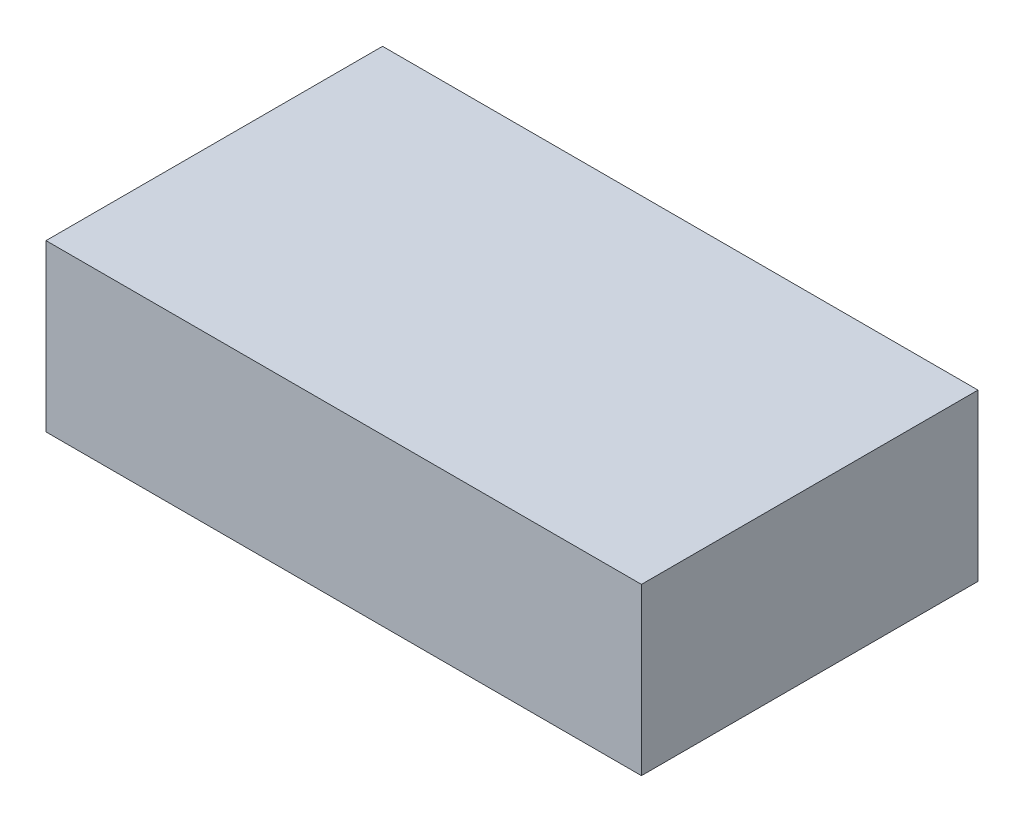
ISO-10303-21;
HEADER;
FILE_DESCRIPTION(('STEP AP214'),'2;1');
FILE_NAME('part.step','',(''),(''),'','','');
FILE_SCHEMA(('AUTOMOTIVE_DESIGN { 1 0 10303 214 1 1 1 1 }'));
ENDSEC;
DATA;
#1=APPLICATION_CONTEXT('core data for automotive mechanical design processes');
#2=APPLICATION_PROTOCOL_DEFINITION('international standard','automotive_design',2000,#1);
#3=PRODUCT_CONTEXT('',#1,'mechanical');
#4=PRODUCT('Part','Part','',(#3));
#5=PRODUCT_RELATED_PRODUCT_CATEGORY('part','',(#4));
#6=PRODUCT_DEFINITION_FORMATION('','',#4);
#7=PRODUCT_DEFINITION_CONTEXT('part definition',#1,'design');
#8=PRODUCT_DEFINITION('design','',#6,#7);
#9=PRODUCT_DEFINITION_SHAPE('','',#8);
#10=(LENGTH_UNIT() NAMED_UNIT(*) SI_UNIT(.MILLI.,.METRE.));
#11=(NAMED_UNIT(*) PLANE_ANGLE_UNIT() SI_UNIT($,.RADIAN.));
#12=(NAMED_UNIT(*) SI_UNIT($,.STERADIAN.) SOLID_ANGLE_UNIT());
#13=UNCERTAINTY_MEASURE_WITH_UNIT(LENGTH_MEASURE(1.E-05),#10,'distance_accuracy_value','');
#14=(GEOMETRIC_REPRESENTATION_CONTEXT(3) GLOBAL_UNCERTAINTY_ASSIGNED_CONTEXT((#13)) GLOBAL_UNIT_ASSIGNED_CONTEXT((#10,
#11,#12)) REPRESENTATION_CONTEXT('',''));
#15=CARTESIAN_POINT('',(0.,0.,0.));
#16=DIRECTION('',(0.,0.,1.));
#17=DIRECTION('',(1.,0.,0.));
#18=AXIS2_PLACEMENT_3D('',#15,#16,#17);
#19=CARTESIAN_POINT('',(-55.9317304388411,32.,22.2740337530528));
#20=DIRECTION('',(1.,0.,0.));
#21=DIRECTION('',(0.,0.,-1.));
#22=AXIS2_PLACEMENT_3D('',#19,#20,#21);
#23=PLANE('',#22);
#24=DIRECTION('',(0.,0.,1.));
#25=VECTOR('',#24,1.);
#26=CARTESIAN_POINT('',(-55.9317304388411,0.,22.2740337530528));
#27=LINE('',#26,#25);
#28=CARTESIAN_POINT('',(-55.9317304388411,0.,-42.7259662469473));
#29=VERTEX_POINT('',#28);
#30=CARTESIAN_POINT('',(-55.9317304388411,0.,22.2740337530528));
#31=VERTEX_POINT('',#30);
#32=EDGE_CURVE('E96',#29,#31,#27,.T.);
#33=ORIENTED_EDGE('',*,*,#32,.T.);
#34=DIRECTION('',(0.,-1.,0.));
#35=VECTOR('',#34,1.);
#36=CARTESIAN_POINT('',(-55.9317304388411,32.,22.2740337530528));
#37=LINE('',#36,#35);
#38=CARTESIAN_POINT('',(-55.9317304388411,32.,22.2740337530528));
#39=VERTEX_POINT('',#38);
#40=EDGE_CURVE('E11',#39,#31,#37,.T.);
#41=ORIENTED_EDGE('',*,*,#40,.F.);
#42=DIRECTION('',(0.,0.,1.));
#43=VECTOR('',#42,1.);
#44=CARTESIAN_POINT('',(-55.9317304388411,32.,22.2740337530528));
#45=LINE('',#44,#43);
#46=CARTESIAN_POINT('',(-55.9317304388411,32.,-42.7259662469473));
#47=VERTEX_POINT('',#46);
#48=EDGE_CURVE('E84',#47,#39,#45,.T.);
#49=ORIENTED_EDGE('',*,*,#48,.F.);
#50=DIRECTION('',(0.,-1.,0.));
#51=VECTOR('',#50,1.);
#52=CARTESIAN_POINT('',(-55.9317304388411,32.,-42.7259662469473));
#53=LINE('',#52,#51);
#54=EDGE_CURVE('E92',#47,#29,#53,.T.);
#55=ORIENTED_EDGE('',*,*,#54,.T.);
#56=EDGE_LOOP('',(#33,#41,#49,#55));
#57=FACE_BOUND('',#56,.T.);
#58=ADVANCED_FACE('F33',(#57),#23,.F.);
#59=CARTESIAN_POINT('',(-55.9317304388411,32.,22.2740337530528));
#60=DIRECTION('',(0.,0.,-1.));
#61=DIRECTION('',(-1.,0.,0.));
#62=AXIS2_PLACEMENT_3D('',#59,#60,#61);
#63=PLANE('',#62);
#64=DIRECTION('',(1.,0.,0.));
#65=VECTOR('',#64,1.);
#66=CARTESIAN_POINT('',(-55.9317304388411,0.,22.2740337530528));
#67=LINE('',#66,#65);
#68=CARTESIAN_POINT('',(59.0682695611589,0.,22.2740337530528));
#69=VERTEX_POINT('',#68);
#70=EDGE_CURVE('E88',#31,#69,#67,.T.);
#71=ORIENTED_EDGE('',*,*,#70,.T.);
#72=DIRECTION('',(0.,-1.,0.));
#73=VECTOR('',#72,1.);
#74=CARTESIAN_POINT('',(59.0682695611589,32.,22.2740337530528));
#75=LINE('',#74,#73);
#76=CARTESIAN_POINT('',(59.0682695611589,32.,22.2740337530528));
#77=VERTEX_POINT('',#76);
#78=EDGE_CURVE('E41',#77,#69,#75,.T.);
#79=ORIENTED_EDGE('',*,*,#78,.F.);
#80=DIRECTION('',(1.,0.,0.));
#81=VECTOR('',#80,1.);
#82=CARTESIAN_POINT('',(-55.9317304388411,32.,22.2740337530528));
#83=LINE('',#82,#81);
#84=EDGE_CURVE('E79',#39,#77,#83,.T.);
#85=ORIENTED_EDGE('',*,*,#84,.F.);
#86=ORIENTED_EDGE('',*,*,#40,.T.);
#87=EDGE_LOOP('',(#71,#79,#85,#86));
#88=FACE_BOUND('',#87,.T.);
#89=ADVANCED_FACE('F87',(#88),#63,.F.);
#90=CARTESIAN_POINT('',(59.0682695611589,32.,22.2740337530528));
#91=DIRECTION('',(-1.,0.,0.));
#92=DIRECTION('',(0.,0.,1.));
#93=AXIS2_PLACEMENT_3D('',#90,#91,#92);
#94=PLANE('',#93);
#95=DIRECTION('',(0.,0.,-1.));
#96=VECTOR('',#95,1.);
#97=CARTESIAN_POINT('',(59.0682695611589,0.,22.2740337530528));
#98=LINE('',#97,#96);
#99=CARTESIAN_POINT('',(59.0682695611589,0.,-42.7259662469473));
#100=VERTEX_POINT('',#99);
#101=EDGE_CURVE('E66',#69,#100,#98,.T.);
#102=ORIENTED_EDGE('',*,*,#101,.T.);
#103=DIRECTION('',(0.,-1.,0.));
#104=VECTOR('',#103,1.);
#105=CARTESIAN_POINT('',(59.0682695611589,32.,-42.7259662469473));
#106=LINE('',#105,#104);
#107=CARTESIAN_POINT('',(59.0682695611589,32.,-42.7259662469473));
#108=VERTEX_POINT('',#107);
#109=EDGE_CURVE('E89',#108,#100,#106,.T.);
#110=ORIENTED_EDGE('',*,*,#109,.F.);
#111=DIRECTION('',(0.,0.,-1.));
#112=VECTOR('',#111,1.);
#113=CARTESIAN_POINT('',(59.0682695611589,32.,22.2740337530528));
#114=LINE('',#113,#112);
#115=EDGE_CURVE('E82',#77,#108,#114,.T.);
#116=ORIENTED_EDGE('',*,*,#115,.F.);
#117=ORIENTED_EDGE('',*,*,#78,.T.);
#118=EDGE_LOOP('',(#102,#110,#116,#117));
#119=FACE_BOUND('',#118,.T.);
#120=ADVANCED_FACE('F90',(#119),#94,.F.);
#121=CARTESIAN_POINT('',(-55.9317304388411,32.,-42.7259662469473));
#122=DIRECTION('',(0.,0.,1.));
#123=DIRECTION('',(1.,0.,0.));
#124=AXIS2_PLACEMENT_3D('',#121,#122,#123);
#125=PLANE('',#124);
#126=DIRECTION('',(-1.,0.,0.));
#127=VECTOR('',#126,1.);
#128=CARTESIAN_POINT('',(-55.9317304388411,0.,-42.7259662469473));
#129=LINE('',#128,#127);
#130=EDGE_CURVE('E72',#100,#29,#129,.T.);
#131=ORIENTED_EDGE('',*,*,#130,.T.);
#132=ORIENTED_EDGE('',*,*,#54,.F.);
#133=DIRECTION('',(-1.,0.,0.));
#134=VECTOR('',#133,1.);
#135=CARTESIAN_POINT('',(-55.9317304388411,32.,-42.7259662469473));
#136=LINE('',#135,#134);
#137=EDGE_CURVE('E49',#108,#47,#136,.T.);
#138=ORIENTED_EDGE('',*,*,#137,.F.);
#139=ORIENTED_EDGE('',*,*,#109,.T.);
#140=EDGE_LOOP('',(#131,#132,#138,#139));
#141=FACE_BOUND('',#140,.T.);
#142=ADVANCED_FACE('F103',(#141),#125,.F.);
#143=CARTESIAN_POINT('',(0.,32.,0.));
#144=DIRECTION('',(0.,-1.,0.));
#145=DIRECTION('',(0.,0.,-1.));
#146=AXIS2_PLACEMENT_3D('',#143,#144,#145);
#147=PLANE('',#146);
#148=ORIENTED_EDGE('',*,*,#48,.T.);
#149=ORIENTED_EDGE('',*,*,#84,.T.);
#150=ORIENTED_EDGE('',*,*,#115,.T.);
#151=ORIENTED_EDGE('',*,*,#137,.T.);
#152=EDGE_LOOP('',(#148,#149,#150,#151));
#153=FACE_BOUND('',#152,.T.);
#154=ADVANCED_FACE('F80',(#153),#147,.F.);
#155=CARTESIAN_POINT('',(0.,0.,0.));
#156=DIRECTION('',(0.,-1.,0.));
#157=DIRECTION('',(0.,0.,-1.));
#158=AXIS2_PLACEMENT_3D('',#155,#156,#157);
#159=PLANE('',#158);
#160=ORIENTED_EDGE('',*,*,#32,.F.);
#161=ORIENTED_EDGE('',*,*,#130,.F.);
#162=ORIENTED_EDGE('',*,*,#101,.F.);
#163=ORIENTED_EDGE('',*,*,#70,.F.);
#164=EDGE_LOOP('',(#160,#161,#162,#163));
#165=FACE_BOUND('',#164,.T.);
#166=ADVANCED_FACE('F106',(#165),#159,.T.);
#167=CLOSED_SHELL('',(#58,#89,#120,#142,#154,#166));
#168=MANIFOLD_SOLID_BREP('B2',#167);
#169=ADVANCED_BREP_SHAPE_REPRESENTATION('',(#18,#168),#14);
#170=SHAPE_DEFINITION_REPRESENTATION(#9,#169);
ENDSEC;
END-ISO-10303-21;
